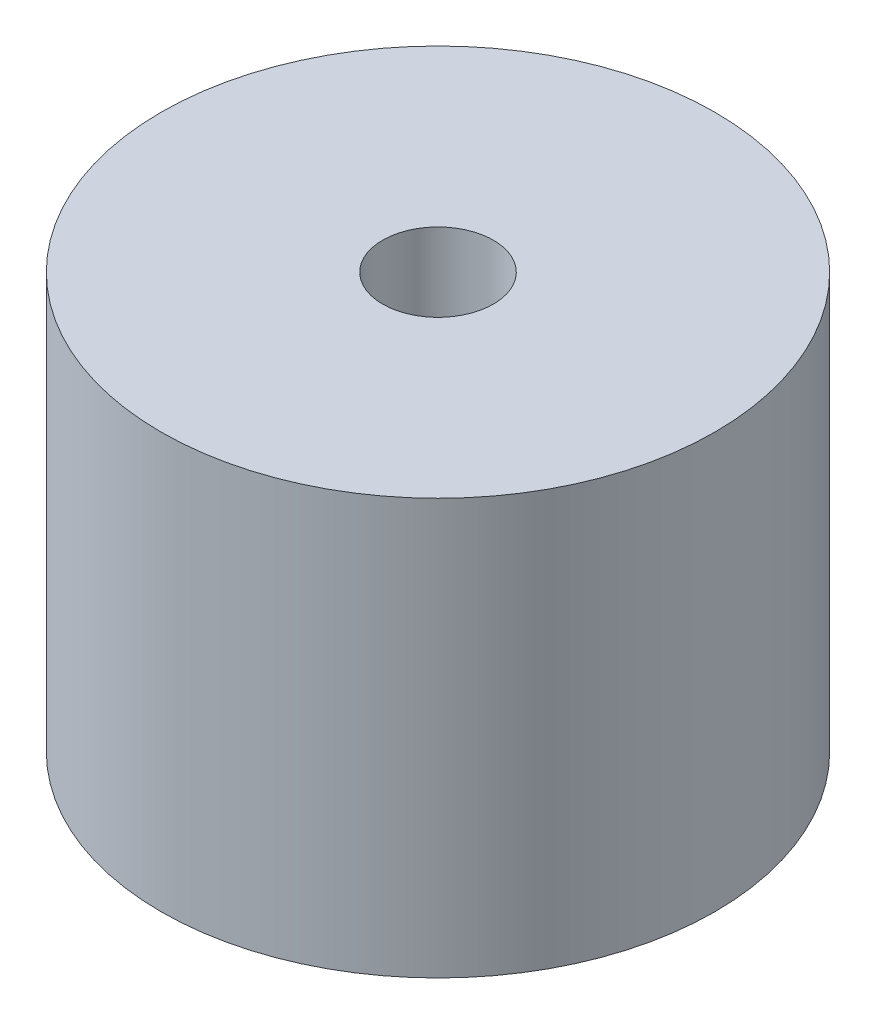
ISO-10303-21;
HEADER;
FILE_DESCRIPTION(('STEP AP214'),'2;1');
FILE_NAME('part.step','',(''),(''),'','','');
FILE_SCHEMA(('AUTOMOTIVE_DESIGN { 1 0 10303 214 1 1 1 1 }'));
ENDSEC;
DATA;
#1=APPLICATION_CONTEXT('core data for automotive mechanical design processes');
#2=APPLICATION_PROTOCOL_DEFINITION('international standard','automotive_design',2000,#1);
#3=PRODUCT_CONTEXT('',#1,'mechanical');
#4=PRODUCT('Part','Part','',(#3));
#5=PRODUCT_RELATED_PRODUCT_CATEGORY('part','',(#4));
#6=PRODUCT_DEFINITION_FORMATION('','',#4);
#7=PRODUCT_DEFINITION_CONTEXT('part definition',#1,'design');
#8=PRODUCT_DEFINITION('design','',#6,#7);
#9=PRODUCT_DEFINITION_SHAPE('','',#8);
#10=(LENGTH_UNIT() NAMED_UNIT(*) SI_UNIT(.MILLI.,.METRE.));
#11=(NAMED_UNIT(*) PLANE_ANGLE_UNIT() SI_UNIT($,.RADIAN.));
#12=(NAMED_UNIT(*) SI_UNIT($,.STERADIAN.) SOLID_ANGLE_UNIT());
#13=UNCERTAINTY_MEASURE_WITH_UNIT(LENGTH_MEASURE(1.E-05),#10,'distance_accuracy_value','');
#14=(GEOMETRIC_REPRESENTATION_CONTEXT(3) GLOBAL_UNCERTAINTY_ASSIGNED_CONTEXT((#13)) GLOBAL_UNIT_ASSIGNED_CONTEXT((#10,
#11,#12)) REPRESENTATION_CONTEXT('',''));
#15=CARTESIAN_POINT('',(0.,0.,0.));
#16=DIRECTION('',(0.,0.,1.));
#17=DIRECTION('',(1.,0.,0.));
#18=AXIS2_PLACEMENT_3D('',#15,#16,#17);
#19=CARTESIAN_POINT('',(0.,15.,0.));
#20=DIRECTION('',(0.,1.,0.));
#21=DIRECTION('',(0.,0.,1.));
#22=AXIS2_PLACEMENT_3D('',#19,#20,#21);
#23=PLANE('',#22);
#24=CARTESIAN_POINT('',(0.,15.,0.));
#25=DIRECTION('',(0.,1.,0.));
#26=DIRECTION('',(0.,0.,1.));
#27=AXIS2_PLACEMENT_3D('',#24,#25,#26);
#28=CIRCLE('',#27,10.);
#29=CARTESIAN_POINT('',(0.,15.,10.));
#30=VERTEX_POINT('',#29);
#31=EDGE_CURVE('E10',#30,#30,#28,.T.);
#32=ORIENTED_EDGE('',*,*,#31,.T.);
#33=EDGE_LOOP('',(#32));
#34=FACE_BOUND('',#33,.T.);
#35=CARTESIAN_POINT('',(0.,15.,0.));
#36=DIRECTION('',(0.,1.,0.));
#37=DIRECTION('',(0.,0.,1.));
#38=AXIS2_PLACEMENT_3D('',#35,#36,#37);
#39=CIRCLE('',#38,2.);
#40=CARTESIAN_POINT('',(0.,15.,2.));
#41=VERTEX_POINT('',#40);
#42=EDGE_CURVE('E46',#41,#41,#39,.T.);
#43=ORIENTED_EDGE('',*,*,#42,.F.);
#44=EDGE_LOOP('',(#43));
#45=FACE_BOUND('',#44,.T.);
#46=ADVANCED_FACE('F35',(#34,#45),#23,.T.);
#47=CARTESIAN_POINT('',(0.,0.,0.));
#48=DIRECTION('',(0.,1.,0.));
#49=DIRECTION('',(0.,0.,1.));
#50=AXIS2_PLACEMENT_3D('',#47,#48,#49);
#51=PLANE('',#50);
#52=CARTESIAN_POINT('',(0.,0.,0.));
#53=DIRECTION('',(0.,1.,0.));
#54=DIRECTION('',(0.,0.,1.));
#55=AXIS2_PLACEMENT_3D('',#52,#53,#54);
#56=CIRCLE('',#55,10.);
#57=CARTESIAN_POINT('',(0.,0.,10.));
#58=VERTEX_POINT('',#57);
#59=EDGE_CURVE('E39',#58,#58,#56,.T.);
#60=ORIENTED_EDGE('',*,*,#59,.F.);
#61=EDGE_LOOP('',(#60));
#62=FACE_BOUND('',#61,.T.);
#63=CARTESIAN_POINT('',(0.,0.,0.));
#64=DIRECTION('',(0.,1.,0.));
#65=DIRECTION('',(0.,0.,1.));
#66=AXIS2_PLACEMENT_3D('',#63,#64,#65);
#67=CIRCLE('',#66,2.);
#68=CARTESIAN_POINT('',(0.,0.,2.));
#69=VERTEX_POINT('',#68);
#70=EDGE_CURVE('E48',#69,#69,#67,.T.);
#71=ORIENTED_EDGE('',*,*,#70,.T.);
#72=EDGE_LOOP('',(#71));
#73=FACE_BOUND('',#72,.T.);
#74=ADVANCED_FACE('F58',(#62,#73),#51,.F.);
#75=CARTESIAN_POINT('',(0.,15.,0.));
#76=DIRECTION('',(0.,-1.,0.));
#77=DIRECTION('',(0.,0.,-1.));
#78=AXIS2_PLACEMENT_3D('',#75,#76,#77);
#79=CYLINDRICAL_SURFACE('',#78,10.);
#80=ORIENTED_EDGE('',*,*,#31,.F.);
#81=EDGE_LOOP('',(#80));
#82=FACE_BOUND('',#81,.T.);
#83=ORIENTED_EDGE('',*,*,#59,.T.);
#84=EDGE_LOOP('',(#83));
#85=FACE_BOUND('',#84,.T.);
#86=ADVANCED_FACE('F37',(#82,#85),#79,.T.);
#87=CARTESIAN_POINT('',(0.,15.,0.));
#88=DIRECTION('',(0.,-1.,0.));
#89=DIRECTION('',(0.,0.,-1.));
#90=AXIS2_PLACEMENT_3D('',#87,#88,#89);
#91=CYLINDRICAL_SURFACE('',#90,2.);
#92=ORIENTED_EDGE('',*,*,#42,.T.);
#93=EDGE_LOOP('',(#92));
#94=FACE_BOUND('',#93,.T.);
#95=ORIENTED_EDGE('',*,*,#70,.F.);
#96=EDGE_LOOP('',(#95));
#97=FACE_BOUND('',#96,.T.);
#98=ADVANCED_FACE('F54',(#94,#97),#91,.F.);
#99=CLOSED_SHELL('',(#46,#74,#86,#98));
#100=MANIFOLD_SOLID_BREP('B2',#99);
#101=ADVANCED_BREP_SHAPE_REPRESENTATION('',(#18,#100),#14);
#102=SHAPE_DEFINITION_REPRESENTATION(#9,#101);
ENDSEC;
END-ISO-10303-21;
